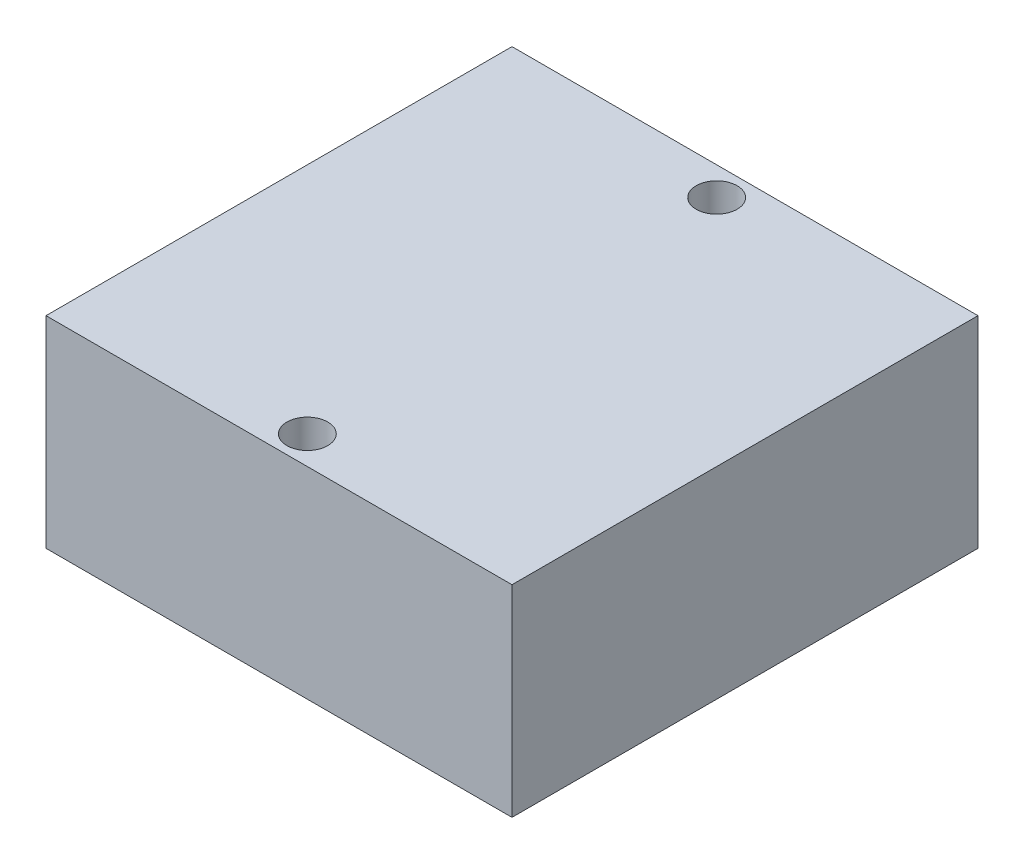
ISO-10303-21;
HEADER;
FILE_DESCRIPTION(('STEP AP214'),'2;1');
FILE_NAME('part.step','',(''),(''),'','','');
FILE_SCHEMA(('AUTOMOTIVE_DESIGN { 1 0 10303 214 1 1 1 1 }'));
ENDSEC;
DATA;
#1=APPLICATION_CONTEXT('core data for automotive mechanical design processes');
#2=APPLICATION_PROTOCOL_DEFINITION('international standard','automotive_design',2000,#1);
#3=PRODUCT_CONTEXT('',#1,'mechanical');
#4=PRODUCT('Part','Part','',(#3));
#5=PRODUCT_RELATED_PRODUCT_CATEGORY('part','',(#4));
#6=PRODUCT_DEFINITION_FORMATION('','',#4);
#7=PRODUCT_DEFINITION_CONTEXT('part definition',#1,'design');
#8=PRODUCT_DEFINITION('design','',#6,#7);
#9=PRODUCT_DEFINITION_SHAPE('','',#8);
#10=(LENGTH_UNIT() NAMED_UNIT(*) SI_UNIT(.MILLI.,.METRE.));
#11=(NAMED_UNIT(*) PLANE_ANGLE_UNIT() SI_UNIT($,.RADIAN.));
#12=(NAMED_UNIT(*) SI_UNIT($,.STERADIAN.) SOLID_ANGLE_UNIT());
#13=UNCERTAINTY_MEASURE_WITH_UNIT(LENGTH_MEASURE(1.E-05),#10,'distance_accuracy_value','');
#14=(GEOMETRIC_REPRESENTATION_CONTEXT(3) GLOBAL_UNCERTAINTY_ASSIGNED_CONTEXT((#13)) GLOBAL_UNIT_ASSIGNED_CONTEXT((#10,
#11,#12)) REPRESENTATION_CONTEXT('',''));
#15=CARTESIAN_POINT('',(0.,0.,0.));
#16=DIRECTION('',(0.,0.,1.));
#17=DIRECTION('',(1.,0.,0.));
#18=AXIS2_PLACEMENT_3D('',#15,#16,#17);
#19=CARTESIAN_POINT('',(37.,32.,37.));
#20=DIRECTION('',(-1.,0.,0.));
#21=DIRECTION('',(0.,0.,1.));
#22=AXIS2_PLACEMENT_3D('',#19,#20,#21);
#23=PLANE('',#22);
#24=DIRECTION('',(0.,0.,-1.));
#25=VECTOR('',#24,1.);
#26=CARTESIAN_POINT('',(37.,0.,37.));
#27=LINE('',#26,#25);
#28=CARTESIAN_POINT('',(37.,0.,37.));
#29=VERTEX_POINT('',#28);
#30=CARTESIAN_POINT('',(37.,0.,-37.));
#31=VERTEX_POINT('',#30);
#32=EDGE_CURVE('E98',#29,#31,#27,.T.);
#33=ORIENTED_EDGE('',*,*,#32,.T.);
#34=DIRECTION('',(0.,-1.,0.));
#35=VECTOR('',#34,1.);
#36=CARTESIAN_POINT('',(37.,32.,-37.));
#37=LINE('',#36,#35);
#38=CARTESIAN_POINT('',(37.,32.,-37.));
#39=VERTEX_POINT('',#38);
#40=EDGE_CURVE('E11',#39,#31,#37,.T.);
#41=ORIENTED_EDGE('',*,*,#40,.F.);
#42=DIRECTION('',(0.,0.,-1.));
#43=VECTOR('',#42,1.);
#44=CARTESIAN_POINT('',(37.,32.,37.));
#45=LINE('',#44,#43);
#46=CARTESIAN_POINT('',(37.,32.,37.));
#47=VERTEX_POINT('',#46);
#48=EDGE_CURVE('E86',#47,#39,#45,.T.);
#49=ORIENTED_EDGE('',*,*,#48,.F.);
#50=DIRECTION('',(0.,-1.,0.));
#51=VECTOR('',#50,1.);
#52=CARTESIAN_POINT('',(37.,32.,37.));
#53=LINE('',#52,#51);
#54=EDGE_CURVE('E94',#47,#29,#53,.T.);
#55=ORIENTED_EDGE('',*,*,#54,.T.);
#56=EDGE_LOOP('',(#33,#41,#49,#55));
#57=FACE_BOUND('',#56,.T.);
#58=ADVANCED_FACE('F35',(#57),#23,.F.);
#59=CARTESIAN_POINT('',(-37.,32.,-37.));
#60=DIRECTION('',(0.,0.,1.));
#61=DIRECTION('',(1.,0.,0.));
#62=AXIS2_PLACEMENT_3D('',#59,#60,#61);
#63=PLANE('',#62);
#64=DIRECTION('',(-1.,0.,0.));
#65=VECTOR('',#64,1.);
#66=CARTESIAN_POINT('',(-37.,0.,-37.));
#67=LINE('',#66,#65);
#68=CARTESIAN_POINT('',(-37.,0.,-37.));
#69=VERTEX_POINT('',#68);
#70=EDGE_CURVE('E90',#31,#69,#67,.T.);
#71=ORIENTED_EDGE('',*,*,#70,.T.);
#72=DIRECTION('',(0.,-1.,0.));
#73=VECTOR('',#72,1.);
#74=CARTESIAN_POINT('',(-37.,32.,-37.));
#75=LINE('',#74,#73);
#76=CARTESIAN_POINT('',(-37.,32.,-37.));
#77=VERTEX_POINT('',#76);
#78=EDGE_CURVE('E43',#77,#69,#75,.T.);
#79=ORIENTED_EDGE('',*,*,#78,.F.);
#80=DIRECTION('',(-1.,0.,0.));
#81=VECTOR('',#80,1.);
#82=CARTESIAN_POINT('',(-37.,32.,-37.));
#83=LINE('',#82,#81);
#84=EDGE_CURVE('E81',#39,#77,#83,.T.);
#85=ORIENTED_EDGE('',*,*,#84,.F.);
#86=ORIENTED_EDGE('',*,*,#40,.T.);
#87=EDGE_LOOP('',(#71,#79,#85,#86));
#88=FACE_BOUND('',#87,.T.);
#89=ADVANCED_FACE('F89',(#88),#63,.F.);
#90=CARTESIAN_POINT('',(-37.,32.,37.));
#91=DIRECTION('',(1.,0.,0.));
#92=DIRECTION('',(0.,0.,-1.));
#93=AXIS2_PLACEMENT_3D('',#90,#91,#92);
#94=PLANE('',#93);
#95=DIRECTION('',(0.,0.,1.));
#96=VECTOR('',#95,1.);
#97=CARTESIAN_POINT('',(-37.,0.,37.));
#98=LINE('',#97,#96);
#99=CARTESIAN_POINT('',(-37.,0.,37.));
#100=VERTEX_POINT('',#99);
#101=EDGE_CURVE('E68',#69,#100,#98,.T.);
#102=ORIENTED_EDGE('',*,*,#101,.T.);
#103=DIRECTION('',(0.,-1.,0.));
#104=VECTOR('',#103,1.);
#105=CARTESIAN_POINT('',(-37.,32.,37.));
#106=LINE('',#105,#104);
#107=CARTESIAN_POINT('',(-37.,32.,37.));
#108=VERTEX_POINT('',#107);
#109=EDGE_CURVE('E91',#108,#100,#106,.T.);
#110=ORIENTED_EDGE('',*,*,#109,.F.);
#111=DIRECTION('',(0.,0.,1.));
#112=VECTOR('',#111,1.);
#113=CARTESIAN_POINT('',(-37.,32.,37.));
#114=LINE('',#113,#112);
#115=EDGE_CURVE('E84',#77,#108,#114,.T.);
#116=ORIENTED_EDGE('',*,*,#115,.F.);
#117=ORIENTED_EDGE('',*,*,#78,.T.);
#118=EDGE_LOOP('',(#102,#110,#116,#117));
#119=FACE_BOUND('',#118,.T.);
#120=ADVANCED_FACE('F92',(#119),#94,.F.);
#121=CARTESIAN_POINT('',(-37.,32.,37.));
#122=DIRECTION('',(0.,0.,-1.));
#123=DIRECTION('',(-1.,0.,0.));
#124=AXIS2_PLACEMENT_3D('',#121,#122,#123);
#125=PLANE('',#124);
#126=DIRECTION('',(1.,0.,0.));
#127=VECTOR('',#126,1.);
#128=CARTESIAN_POINT('',(-37.,0.,37.));
#129=LINE('',#128,#127);
#130=EDGE_CURVE('E74',#100,#29,#129,.T.);
#131=ORIENTED_EDGE('',*,*,#130,.T.);
#132=ORIENTED_EDGE('',*,*,#54,.F.);
#133=DIRECTION('',(1.,0.,0.));
#134=VECTOR('',#133,1.);
#135=CARTESIAN_POINT('',(-37.,32.,37.));
#136=LINE('',#135,#134);
#137=EDGE_CURVE('E51',#108,#47,#136,.T.);
#138=ORIENTED_EDGE('',*,*,#137,.F.);
#139=ORIENTED_EDGE('',*,*,#109,.T.);
#140=EDGE_LOOP('',(#131,#132,#138,#139));
#141=FACE_BOUND('',#140,.T.);
#142=ADVANCED_FACE('F106',(#141),#125,.F.);
#143=CARTESIAN_POINT('',(0.,32.,0.));
#144=DIRECTION('',(0.,-1.,0.));
#145=DIRECTION('',(0.,0.,-1.));
#146=AXIS2_PLACEMENT_3D('',#143,#144,#145);
#147=PLANE('',#146);
#148=CARTESIAN_POINT('',(0.,32.,-32.5));
#149=DIRECTION('',(0.,1.,0.));
#150=DIRECTION('',(0.,0.,1.));
#151=AXIS2_PLACEMENT_3D('',#148,#149,#150);
#152=CIRCLE('',#151,3.25);
#153=CARTESIAN_POINT('',(0.,32.,-29.25));
#154=VERTEX_POINT('',#153);
#155=EDGE_CURVE('E118',#154,#154,#152,.T.);
#156=ORIENTED_EDGE('',*,*,#155,.F.);
#157=EDGE_LOOP('',(#156));
#158=FACE_BOUND('',#157,.T.);
#159=CARTESIAN_POINT('',(0.,32.,32.5));
#160=DIRECTION('',(0.,1.,0.));
#161=DIRECTION('',(0.,0.,1.));
#162=AXIS2_PLACEMENT_3D('',#159,#160,#161);
#163=CIRCLE('',#162,3.25);
#164=CARTESIAN_POINT('',(0.,32.,35.75));
#165=VERTEX_POINT('',#164);
#166=EDGE_CURVE('E112',#165,#165,#163,.T.);
#167=ORIENTED_EDGE('',*,*,#166,.F.);
#168=EDGE_LOOP('',(#167));
#169=FACE_BOUND('',#168,.T.);
#170=ORIENTED_EDGE('',*,*,#48,.T.);
#171=ORIENTED_EDGE('',*,*,#84,.T.);
#172=ORIENTED_EDGE('',*,*,#115,.T.);
#173=ORIENTED_EDGE('',*,*,#137,.T.);
#174=EDGE_LOOP('',(#170,#171,#172,#173));
#175=FACE_BOUND('',#174,.T.);
#176=ADVANCED_FACE('F82',(#158,#169,#175),#147,.F.);
#177=CARTESIAN_POINT('',(0.,0.,0.));
#178=DIRECTION('',(0.,-1.,0.));
#179=DIRECTION('',(0.,0.,-1.));
#180=AXIS2_PLACEMENT_3D('',#177,#178,#179);
#181=PLANE('',#180);
#182=CARTESIAN_POINT('',(0.,0.,-32.5));
#183=DIRECTION('',(0.,1.,0.));
#184=DIRECTION('',(0.,0.,1.));
#185=AXIS2_PLACEMENT_3D('',#182,#183,#184);
#186=CIRCLE('',#185,3.25);
#187=CARTESIAN_POINT('',(0.,0.,-29.25));
#188=VERTEX_POINT('',#187);
#189=EDGE_CURVE('E101',#188,#188,#186,.T.);
#190=ORIENTED_EDGE('',*,*,#189,.T.);
#191=EDGE_LOOP('',(#190));
#192=FACE_BOUND('',#191,.T.);
#193=CARTESIAN_POINT('',(0.,0.,32.5));
#194=DIRECTION('',(0.,1.,0.));
#195=DIRECTION('',(0.,0.,1.));
#196=AXIS2_PLACEMENT_3D('',#193,#194,#195);
#197=CIRCLE('',#196,3.25);
#198=CARTESIAN_POINT('',(0.,0.,35.75));
#199=VERTEX_POINT('',#198);
#200=EDGE_CURVE('E115',#199,#199,#197,.T.);
#201=ORIENTED_EDGE('',*,*,#200,.T.);
#202=EDGE_LOOP('',(#201));
#203=FACE_BOUND('',#202,.T.);
#204=ORIENTED_EDGE('',*,*,#32,.F.);
#205=ORIENTED_EDGE('',*,*,#130,.F.);
#206=ORIENTED_EDGE('',*,*,#101,.F.);
#207=ORIENTED_EDGE('',*,*,#70,.F.);
#208=EDGE_LOOP('',(#204,#205,#206,#207));
#209=FACE_BOUND('',#208,.T.);
#210=ADVANCED_FACE('F109',(#192,#203,#209),#181,.T.);
#211=CARTESIAN_POINT('',(0.,0.,32.5));
#212=DIRECTION('',(0.,1.,0.));
#213=DIRECTION('',(0.,0.,1.));
#214=AXIS2_PLACEMENT_3D('',#211,#212,#213);
#215=CYLINDRICAL_SURFACE('',#214,3.25);
#216=ORIENTED_EDGE('',*,*,#200,.F.);
#217=EDGE_LOOP('',(#216));
#218=FACE_BOUND('',#217,.T.);
#219=ORIENTED_EDGE('',*,*,#166,.T.);
#220=EDGE_LOOP('',(#219));
#221=FACE_BOUND('',#220,.T.);
#222=ADVANCED_FACE('F129',(#218,#221),#215,.F.);
#223=CARTESIAN_POINT('',(0.,0.,-32.5));
#224=DIRECTION('',(0.,1.,0.));
#225=DIRECTION('',(0.,0.,1.));
#226=AXIS2_PLACEMENT_3D('',#223,#224,#225);
#227=CYLINDRICAL_SURFACE('',#226,3.25);
#228=ORIENTED_EDGE('',*,*,#189,.F.);
#229=EDGE_LOOP('',(#228));
#230=FACE_BOUND('',#229,.T.);
#231=ORIENTED_EDGE('',*,*,#155,.T.);
#232=EDGE_LOOP('',(#231));
#233=FACE_BOUND('',#232,.T.);
#234=ADVANCED_FACE('F126',(#230,#233),#227,.F.);
#235=CLOSED_SHELL('',(#58,#89,#120,#142,#176,#210,#222,#234));
#236=MANIFOLD_SOLID_BREP('B2',#235);
#237=ADVANCED_BREP_SHAPE_REPRESENTATION('',(#18,#236),#14);
#238=SHAPE_DEFINITION_REPRESENTATION(#9,#237);
ENDSEC;
END-ISO-10303-21;
